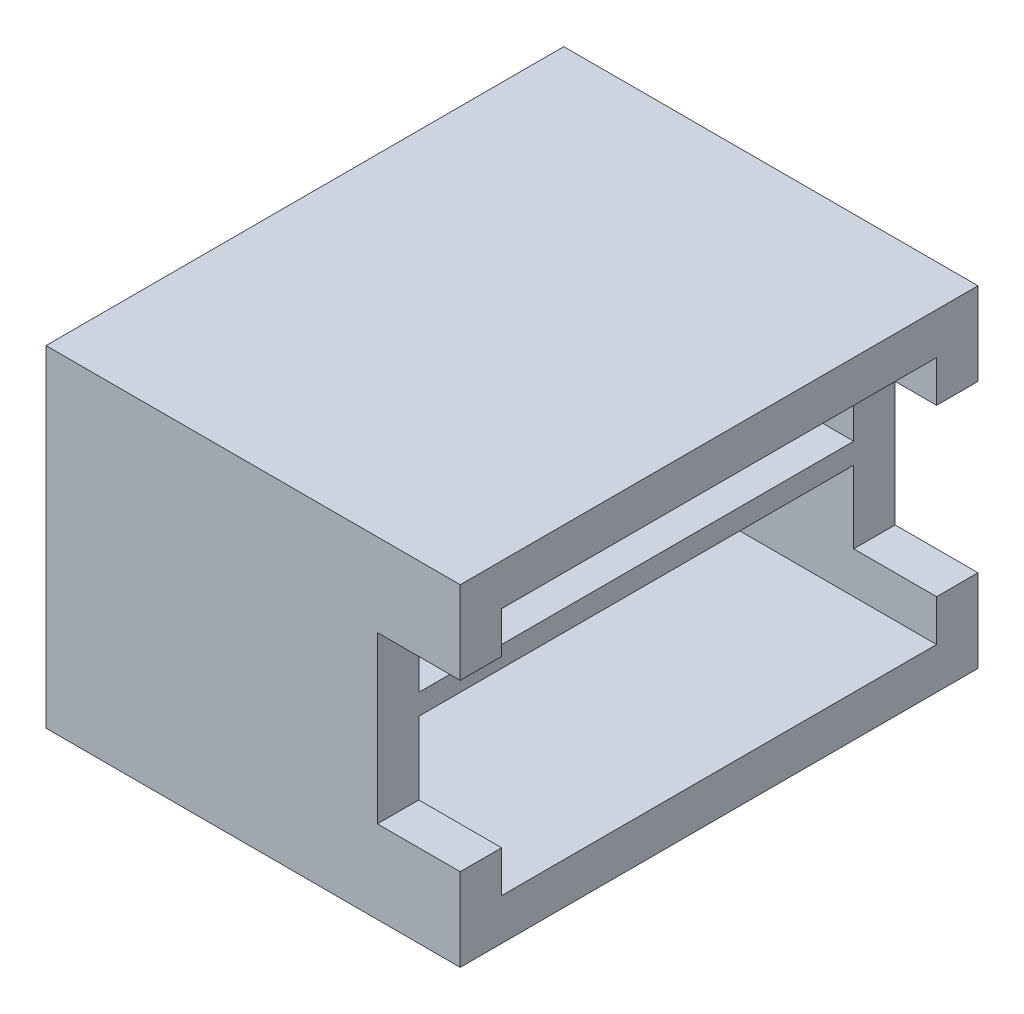
ISO-10303-21;
HEADER;
FILE_DESCRIPTION(('STEP AP214'),'2;1');
FILE_NAME('part.step','',(''),(''),'','','');
FILE_SCHEMA(('AUTOMOTIVE_DESIGN { 1 0 10303 214 1 1 1 1 }'));
ENDSEC;
DATA;
#1=APPLICATION_CONTEXT('core data for automotive mechanical design processes');
#2=APPLICATION_PROTOCOL_DEFINITION('international standard','automotive_design',2000,#1);
#3=PRODUCT_CONTEXT('',#1,'mechanical');
#4=PRODUCT('Part','Part','',(#3));
#5=PRODUCT_RELATED_PRODUCT_CATEGORY('part','',(#4));
#6=PRODUCT_DEFINITION_FORMATION('','',#4);
#7=PRODUCT_DEFINITION_CONTEXT('part definition',#1,'design');
#8=PRODUCT_DEFINITION('design','',#6,#7);
#9=PRODUCT_DEFINITION_SHAPE('','',#8);
#10=(LENGTH_UNIT() NAMED_UNIT(*) SI_UNIT(.MILLI.,.METRE.));
#11=(NAMED_UNIT(*) PLANE_ANGLE_UNIT() SI_UNIT($,.RADIAN.));
#12=(NAMED_UNIT(*) SI_UNIT($,.STERADIAN.) SOLID_ANGLE_UNIT());
#13=UNCERTAINTY_MEASURE_WITH_UNIT(LENGTH_MEASURE(1.E-05),#10,'distance_accuracy_value','');
#14=(GEOMETRIC_REPRESENTATION_CONTEXT(3) GLOBAL_UNCERTAINTY_ASSIGNED_CONTEXT((#13)) GLOBAL_UNIT_ASSIGNED_CONTEXT((#10,
#11,#12)) REPRESENTATION_CONTEXT('',''));
#15=CARTESIAN_POINT('',(0.,0.,0.));
#16=DIRECTION('',(0.,0.,1.));
#17=DIRECTION('',(1.,0.,0.));
#18=AXIS2_PLACEMENT_3D('',#15,#16,#17);
#19=CARTESIAN_POINT('',(-7.99999999999999,16.,10.5));
#20=DIRECTION('',(0.,0.,1.));
#21=DIRECTION('',(0.,-1.,0.));
#22=AXIS2_PLACEMENT_3D('',#19,#20,#21);
#23=PLANE('',#22);
#24=DIRECTION('',(1.,0.,0.));
#25=VECTOR('',#24,1.);
#26=CARTESIAN_POINT('',(6.,12.,10.5));
#27=LINE('',#26,#25);
#28=CARTESIAN_POINT('',(6.,12.,10.5));
#29=VERTEX_POINT('',#28);
#30=CARTESIAN_POINT('',(10.,12.,10.5));
#31=VERTEX_POINT('',#30);
#32=EDGE_CURVE('E276',#29,#31,#27,.T.);
#33=ORIENTED_EDGE('',*,*,#32,.F.);
#34=DIRECTION('',(0.,-1.,0.));
#35=VECTOR('',#34,1.);
#36=CARTESIAN_POINT('',(6.,0.,10.5));
#37=LINE('',#36,#35);
#38=CARTESIAN_POINT('',(6.,8.5,10.5));
#39=VERTEX_POINT('',#38);
#40=EDGE_CURVE('E267',#29,#39,#37,.T.);
#41=ORIENTED_EDGE('',*,*,#40,.T.);
#42=DIRECTION('',(-1.,0.,0.));
#43=VECTOR('',#42,1.);
#44=CARTESIAN_POINT('',(6.,8.5,10.5));
#45=LINE('',#44,#43);
#46=CARTESIAN_POINT('',(-7.99999999999999,8.5,10.5));
#47=VERTEX_POINT('',#46);
#48=EDGE_CURVE('E315',#39,#47,#45,.T.);
#49=ORIENTED_EDGE('',*,*,#48,.T.);
#50=DIRECTION('',(0.,-1.,0.));
#51=VECTOR('',#50,1.);
#52=CARTESIAN_POINT('',(-7.99999999999999,16.,10.5));
#53=LINE('',#52,#51);
#54=CARTESIAN_POINT('',(-7.99999999999999,14.,10.5));
#55=VERTEX_POINT('',#54);
#56=EDGE_CURVE('E336',#55,#47,#53,.T.);
#57=ORIENTED_EDGE('',*,*,#56,.F.);
#58=DIRECTION('',(1.,0.,0.));
#59=VECTOR('',#58,1.);
#60=CARTESIAN_POINT('',(-7.99999999999999,14.,10.5));
#61=LINE('',#60,#59);
#62=CARTESIAN_POINT('',(10.,14.,10.5));
#63=VERTEX_POINT('',#62);
#64=EDGE_CURVE('E355',#55,#63,#61,.T.);
#65=ORIENTED_EDGE('',*,*,#64,.T.);
#66=DIRECTION('',(0.,-1.,0.));
#67=VECTOR('',#66,1.);
#68=CARTESIAN_POINT('',(10.,16.,10.5));
#69=LINE('',#68,#67);
#70=EDGE_CURVE('E328',#63,#31,#69,.T.);
#71=ORIENTED_EDGE('',*,*,#70,.T.);
#72=EDGE_LOOP('',(#33,#41,#49,#57,#65,#71));
#73=FACE_BOUND('',#72,.T.);
#74=ADVANCED_FACE('F39',(#73),#23,.F.);
#75=DIRECTION('',(1.,0.,0.));
#76=VECTOR('',#75,1.);
#77=CARTESIAN_POINT('',(6.,4.,10.5));
#78=LINE('',#77,#76);
#79=CARTESIAN_POINT('',(6.,4.,10.5));
#80=VERTEX_POINT('',#79);
#81=CARTESIAN_POINT('',(10.,4.,10.5));
#82=VERTEX_POINT('',#81);
#83=EDGE_CURVE('E273',#80,#82,#78,.T.);
#84=ORIENTED_EDGE('',*,*,#83,.T.);
#85=CARTESIAN_POINT('',(10.,2.,10.5));
#86=VERTEX_POINT('',#85);
#87=EDGE_CURVE('E348',#82,#86,#69,.T.);
#88=ORIENTED_EDGE('',*,*,#87,.T.);
#89=DIRECTION('',(1.,0.,0.));
#90=VECTOR('',#89,1.);
#91=CARTESIAN_POINT('',(-7.99999999999999,2.,10.5));
#92=LINE('',#91,#90);
#93=CARTESIAN_POINT('',(-7.99999999999999,2.,10.5));
#94=VERTEX_POINT('',#93);
#95=EDGE_CURVE('E351',#94,#86,#92,.T.);
#96=ORIENTED_EDGE('',*,*,#95,.F.);
#97=CARTESIAN_POINT('',(-7.99999999999999,7.5,10.5));
#98=VERTEX_POINT('',#97);
#99=EDGE_CURVE('E335',#98,#94,#53,.T.);
#100=ORIENTED_EDGE('',*,*,#99,.F.);
#101=DIRECTION('',(-1.,0.,0.));
#102=VECTOR('',#101,1.);
#103=CARTESIAN_POINT('',(6.,7.5,10.5));
#104=LINE('',#103,#102);
#105=CARTESIAN_POINT('',(6.,7.5,10.5));
#106=VERTEX_POINT('',#105);
#107=EDGE_CURVE('E313',#106,#98,#104,.T.);
#108=ORIENTED_EDGE('',*,*,#107,.F.);
#109=EDGE_CURVE('E266',#106,#80,#37,.T.);
#110=ORIENTED_EDGE('',*,*,#109,.T.);
#111=EDGE_LOOP('',(#84,#88,#96,#100,#108,#110));
#112=FACE_BOUND('',#111,.T.);
#113=ADVANCED_FACE('F480',(#112),#23,.F.);
#114=CARTESIAN_POINT('',(-8.,16.,-10.5));
#115=DIRECTION('',(0.,0.,-1.));
#116=DIRECTION('',(0.,1.,0.));
#117=AXIS2_PLACEMENT_3D('',#114,#115,#116);
#118=PLANE('',#117);
#119=DIRECTION('',(1.,0.,0.));
#120=VECTOR('',#119,1.);
#121=CARTESIAN_POINT('',(6.,4.,-10.5));
#122=LINE('',#121,#120);
#123=CARTESIAN_POINT('',(6.,4.,-10.5));
#124=VERTEX_POINT('',#123);
#125=CARTESIAN_POINT('',(10.,4.,-10.5));
#126=VERTEX_POINT('',#125);
#127=EDGE_CURVE('E291',#124,#126,#122,.T.);
#128=ORIENTED_EDGE('',*,*,#127,.F.);
#129=DIRECTION('',(0.,1.,0.));
#130=VECTOR('',#129,1.);
#131=CARTESIAN_POINT('',(6.,0.,-10.5));
#132=LINE('',#131,#130);
#133=CARTESIAN_POINT('',(6.,7.5,-10.5));
#134=VERTEX_POINT('',#133);
#135=EDGE_CURVE('E282',#124,#134,#132,.T.);
#136=ORIENTED_EDGE('',*,*,#135,.T.);
#137=DIRECTION('',(-1.,0.,0.));
#138=VECTOR('',#137,1.);
#139=CARTESIAN_POINT('',(6.,7.5,-10.5));
#140=LINE('',#139,#138);
#141=CARTESIAN_POINT('',(-8.,7.5,-10.5));
#142=VERTEX_POINT('',#141);
#143=EDGE_CURVE('E320',#134,#142,#140,.T.);
#144=ORIENTED_EDGE('',*,*,#143,.T.);
#145=DIRECTION('',(0.,1.,0.));
#146=VECTOR('',#145,1.);
#147=CARTESIAN_POINT('',(-8.,16.,-10.5));
#148=LINE('',#147,#146);
#149=CARTESIAN_POINT('',(-8.,2.,-10.5));
#150=VERTEX_POINT('',#149);
#151=EDGE_CURVE('E329',#150,#142,#148,.T.);
#152=ORIENTED_EDGE('',*,*,#151,.F.);
#153=DIRECTION('',(1.,0.,0.));
#154=VECTOR('',#153,1.);
#155=CARTESIAN_POINT('',(-8.,2.,-10.5));
#156=LINE('',#155,#154);
#157=CARTESIAN_POINT('',(10.,2.,-10.5));
#158=VERTEX_POINT('',#157);
#159=EDGE_CURVE('E339',#150,#158,#156,.T.);
#160=ORIENTED_EDGE('',*,*,#159,.T.);
#161=DIRECTION('',(0.,1.,0.));
#162=VECTOR('',#161,1.);
#163=CARTESIAN_POINT('',(10.,16.,-10.5));
#164=LINE('',#163,#162);
#165=EDGE_CURVE('E342',#158,#126,#164,.T.);
#166=ORIENTED_EDGE('',*,*,#165,.T.);
#167=EDGE_LOOP('',(#128,#136,#144,#152,#160,#166));
#168=FACE_BOUND('',#167,.T.);
#169=ADVANCED_FACE('F486',(#168),#118,.F.);
#170=DIRECTION('',(1.,0.,0.));
#171=VECTOR('',#170,1.);
#172=CARTESIAN_POINT('',(6.,12.,-10.5));
#173=LINE('',#172,#171);
#174=CARTESIAN_POINT('',(6.,12.,-10.5));
#175=VERTEX_POINT('',#174);
#176=CARTESIAN_POINT('',(10.,12.,-10.5));
#177=VERTEX_POINT('',#176);
#178=EDGE_CURVE('E264',#175,#177,#173,.T.);
#179=ORIENTED_EDGE('',*,*,#178,.T.);
#180=CARTESIAN_POINT('',(10.,14.,-10.5));
#181=VERTEX_POINT('',#180);
#182=EDGE_CURVE('E341',#177,#181,#164,.T.);
#183=ORIENTED_EDGE('',*,*,#182,.T.);
#184=DIRECTION('',(1.,0.,0.));
#185=VECTOR('',#184,1.);
#186=CARTESIAN_POINT('',(-8.,14.,-10.5));
#187=LINE('',#186,#185);
#188=CARTESIAN_POINT('',(-8.,14.,-10.5));
#189=VERTEX_POINT('',#188);
#190=EDGE_CURVE('E357',#189,#181,#187,.T.);
#191=ORIENTED_EDGE('',*,*,#190,.F.);
#192=CARTESIAN_POINT('',(-8.,8.5,-10.5));
#193=VERTEX_POINT('',#192);
#194=EDGE_CURVE('E327',#193,#189,#148,.T.);
#195=ORIENTED_EDGE('',*,*,#194,.F.);
#196=DIRECTION('',(-1.,0.,0.));
#197=VECTOR('',#196,1.);
#198=CARTESIAN_POINT('',(6.,8.5,-10.5));
#199=LINE('',#198,#197);
#200=CARTESIAN_POINT('',(6.,8.5,-10.5));
#201=VERTEX_POINT('',#200);
#202=EDGE_CURVE('E318',#201,#193,#199,.T.);
#203=ORIENTED_EDGE('',*,*,#202,.F.);
#204=EDGE_CURVE('E251',#201,#175,#132,.T.);
#205=ORIENTED_EDGE('',*,*,#204,.T.);
#206=EDGE_LOOP('',(#179,#183,#191,#195,#203,#205));
#207=FACE_BOUND('',#206,.T.);
#208=ADVANCED_FACE('F501',(#207),#118,.F.);
#209=CARTESIAN_POINT('',(-10.,16.,-12.5));
#210=DIRECTION('',(0.,0.,1.));
#211=DIRECTION('',(1.,0.,0.));
#212=AXIS2_PLACEMENT_3D('',#209,#210,#211);
#213=PLANE('',#212);
#214=DIRECTION('',(1.,0.,0.));
#215=VECTOR('',#214,1.);
#216=CARTESIAN_POINT('',(6.,12.,-12.5));
#217=LINE('',#216,#215);
#218=CARTESIAN_POINT('',(6.,12.,-12.5));
#219=VERTEX_POINT('',#218);
#220=CARTESIAN_POINT('',(10.,12.,-12.5));
#221=VERTEX_POINT('',#220);
#222=EDGE_CURVE('E296',#219,#221,#217,.T.);
#223=ORIENTED_EDGE('',*,*,#222,.F.);
#224=DIRECTION('',(0.,-1.,0.));
#225=VECTOR('',#224,1.);
#226=CARTESIAN_POINT('',(6.,0.,-12.5));
#227=LINE('',#226,#225);
#228=CARTESIAN_POINT('',(6.,4.,-12.5));
#229=VERTEX_POINT('',#228);
#230=EDGE_CURVE('E286',#219,#229,#227,.T.);
#231=ORIENTED_EDGE('',*,*,#230,.T.);
#232=DIRECTION('',(1.,0.,0.));
#233=VECTOR('',#232,1.);
#234=CARTESIAN_POINT('',(6.,4.,-12.5));
#235=LINE('',#234,#233);
#236=CARTESIAN_POINT('',(10.,4.,-12.5));
#237=VERTEX_POINT('',#236);
#238=EDGE_CURVE('E293',#229,#237,#235,.T.);
#239=ORIENTED_EDGE('',*,*,#238,.T.);
#240=DIRECTION('',(0.,-1.,0.));
#241=VECTOR('',#240,1.);
#242=CARTESIAN_POINT('',(10.,16.,-12.5));
#243=LINE('',#242,#241);
#244=CARTESIAN_POINT('',(10.,0.,-12.5));
#245=VERTEX_POINT('',#244);
#246=EDGE_CURVE('E391',#237,#245,#243,.T.);
#247=ORIENTED_EDGE('',*,*,#246,.T.);
#248=DIRECTION('',(-1.,0.,0.));
#249=VECTOR('',#248,1.);
#250=CARTESIAN_POINT('',(-10.,0.,-12.5));
#251=LINE('',#250,#249);
#252=CARTESIAN_POINT('',(-10.,0.,-12.5));
#253=VERTEX_POINT('',#252);
#254=EDGE_CURVE('E375',#245,#253,#251,.T.);
#255=ORIENTED_EDGE('',*,*,#254,.T.);
#256=DIRECTION('',(0.,-1.,0.));
#257=VECTOR('',#256,1.);
#258=CARTESIAN_POINT('',(-10.,16.,-12.5));
#259=LINE('',#258,#257);
#260=CARTESIAN_POINT('',(-10.,16.,-12.5));
#261=VERTEX_POINT('',#260);
#262=EDGE_CURVE('E388',#261,#253,#259,.T.);
#263=ORIENTED_EDGE('',*,*,#262,.F.);
#264=DIRECTION('',(-1.,0.,0.));
#265=VECTOR('',#264,1.);
#266=CARTESIAN_POINT('',(-10.,16.,-12.5));
#267=LINE('',#266,#265);
#268=CARTESIAN_POINT('',(10.,16.,-12.5));
#269=VERTEX_POINT('',#268);
#270=EDGE_CURVE('E365',#269,#261,#267,.T.);
#271=ORIENTED_EDGE('',*,*,#270,.F.);
#272=EDGE_CURVE('E392',#269,#221,#243,.T.);
#273=ORIENTED_EDGE('',*,*,#272,.T.);
#274=EDGE_LOOP('',(#223,#231,#239,#247,#255,#263,#271,#273));
#275=FACE_BOUND('',#274,.T.);
#276=ADVANCED_FACE('F428',(#275),#213,.F.);
#277=CARTESIAN_POINT('',(-10.,16.,12.5));
#278=DIRECTION('',(0.,0.,-1.));
#279=DIRECTION('',(-1.,0.,0.));
#280=AXIS2_PLACEMENT_3D('',#277,#278,#279);
#281=PLANE('',#280);
#282=DIRECTION('',(1.,0.,0.));
#283=VECTOR('',#282,1.);
#284=CARTESIAN_POINT('',(6.,12.,12.5));
#285=LINE('',#284,#283);
#286=CARTESIAN_POINT('',(6.,12.,12.5));
#287=VERTEX_POINT('',#286);
#288=CARTESIAN_POINT('',(10.,12.,12.5));
#289=VERTEX_POINT('',#288);
#290=EDGE_CURVE('E278',#287,#289,#285,.T.);
#291=ORIENTED_EDGE('',*,*,#290,.T.);
#292=DIRECTION('',(0.,-1.,0.));
#293=VECTOR('',#292,1.);
#294=CARTESIAN_POINT('',(10.,16.,12.5));
#295=LINE('',#294,#293);
#296=CARTESIAN_POINT('',(10.,16.,12.5));
#297=VERTEX_POINT('',#296);
#298=EDGE_CURVE('E382',#297,#289,#295,.T.);
#299=ORIENTED_EDGE('',*,*,#298,.F.);
#300=DIRECTION('',(1.,0.,0.));
#301=VECTOR('',#300,1.);
#302=CARTESIAN_POINT('',(-10.,16.,12.5));
#303=LINE('',#302,#301);
#304=CARTESIAN_POINT('',(-10.,16.,12.5));
#305=VERTEX_POINT('',#304);
#306=EDGE_CURVE('E370',#305,#297,#303,.T.);
#307=ORIENTED_EDGE('',*,*,#306,.F.);
#308=DIRECTION('',(0.,-1.,0.));
#309=VECTOR('',#308,1.);
#310=CARTESIAN_POINT('',(-10.,16.,12.5));
#311=LINE('',#310,#309);
#312=CARTESIAN_POINT('',(-10.,0.,12.5));
#313=VERTEX_POINT('',#312);
#314=EDGE_CURVE('E385',#305,#313,#311,.T.);
#315=ORIENTED_EDGE('',*,*,#314,.T.);
#316=DIRECTION('',(1.,0.,0.));
#317=VECTOR('',#316,1.);
#318=CARTESIAN_POINT('',(-10.,0.,12.5));
#319=LINE('',#318,#317);
#320=CARTESIAN_POINT('',(10.,0.,12.5));
#321=VERTEX_POINT('',#320);
#322=EDGE_CURVE('E366',#313,#321,#319,.T.);
#323=ORIENTED_EDGE('',*,*,#322,.T.);
#324=CARTESIAN_POINT('',(10.,4.,12.5));
#325=VERTEX_POINT('',#324);
#326=EDGE_CURVE('E372',#325,#321,#295,.T.);
#327=ORIENTED_EDGE('',*,*,#326,.F.);
#328=DIRECTION('',(1.,0.,0.));
#329=VECTOR('',#328,1.);
#330=CARTESIAN_POINT('',(6.,4.,12.5));
#331=LINE('',#330,#329);
#332=CARTESIAN_POINT('',(6.,4.,12.5));
#333=VERTEX_POINT('',#332);
#334=EDGE_CURVE('E271',#333,#325,#331,.T.);
#335=ORIENTED_EDGE('',*,*,#334,.F.);
#336=DIRECTION('',(0.,1.,0.));
#337=VECTOR('',#336,1.);
#338=CARTESIAN_POINT('',(6.,0.,12.5));
#339=LINE('',#338,#337);
#340=EDGE_CURVE('E260',#333,#287,#339,.T.);
#341=ORIENTED_EDGE('',*,*,#340,.T.);
#342=EDGE_LOOP('',(#291,#299,#307,#315,#323,#327,#335,#341));
#343=FACE_BOUND('',#342,.T.);
#344=ADVANCED_FACE('F440',(#343),#281,.F.);
#345=CARTESIAN_POINT('',(10.,16.,-12.5));
#346=DIRECTION('',(-1.,0.,0.));
#347=DIRECTION('',(0.,0.,1.));
#348=AXIS2_PLACEMENT_3D('',#345,#346,#347);
#349=PLANE('',#348);
#350=DIRECTION('',(0.,0.,1.));
#351=VECTOR('',#350,1.);
#352=CARTESIAN_POINT('',(10.,12.,-12.5));
#353=LINE('',#352,#351);
#354=EDGE_CURVE('E281',#221,#177,#353,.T.);
#355=ORIENTED_EDGE('',*,*,#354,.F.);
#356=ORIENTED_EDGE('',*,*,#272,.F.);
#357=DIRECTION('',(0.,0.,-1.));
#358=VECTOR('',#357,1.);
#359=CARTESIAN_POINT('',(10.,16.,-12.5));
#360=LINE('',#359,#358);
#361=EDGE_CURVE('E362',#297,#269,#360,.T.);
#362=ORIENTED_EDGE('',*,*,#361,.F.);
#363=ORIENTED_EDGE('',*,*,#298,.T.);
#364=DIRECTION('',(0.,0.,1.));
#365=VECTOR('',#364,1.);
#366=CARTESIAN_POINT('',(10.,12.,-12.5));
#367=LINE('',#366,#365);
#368=EDGE_CURVE('E303',#31,#289,#367,.T.);
#369=ORIENTED_EDGE('',*,*,#368,.F.);
#370=ORIENTED_EDGE('',*,*,#70,.F.);
#371=DIRECTION('',(0.,0.,1.));
#372=VECTOR('',#371,1.);
#373=CARTESIAN_POINT('',(10.,14.,-12.5));
#374=LINE('',#373,#372);
#375=EDGE_CURVE('E345',#181,#63,#374,.T.);
#376=ORIENTED_EDGE('',*,*,#375,.F.);
#377=ORIENTED_EDGE('',*,*,#182,.F.);
#378=EDGE_LOOP('',(#355,#356,#362,#363,#369,#370,#376,#377));
#379=FACE_BOUND('',#378,.T.);
#380=ADVANCED_FACE('F41',(#379),#349,.F.);
#381=DIRECTION('',(0.,0.,-1.));
#382=VECTOR('',#381,1.);
#383=CARTESIAN_POINT('',(10.,4.,-12.5));
#384=LINE('',#383,#382);
#385=EDGE_CURVE('E301',#126,#237,#384,.T.);
#386=ORIENTED_EDGE('',*,*,#385,.F.);
#387=ORIENTED_EDGE('',*,*,#165,.F.);
#388=DIRECTION('',(0.,0.,-1.));
#389=VECTOR('',#388,1.);
#390=CARTESIAN_POINT('',(10.,2.,-12.5));
#391=LINE('',#390,#389);
#392=EDGE_CURVE('E323',#86,#158,#391,.T.);
#393=ORIENTED_EDGE('',*,*,#392,.F.);
#394=ORIENTED_EDGE('',*,*,#87,.F.);
#395=DIRECTION('',(0.,0.,-1.));
#396=VECTOR('',#395,1.);
#397=CARTESIAN_POINT('',(10.,4.,-12.5));
#398=LINE('',#397,#396);
#399=EDGE_CURVE('E305',#325,#82,#398,.T.);
#400=ORIENTED_EDGE('',*,*,#399,.F.);
#401=ORIENTED_EDGE('',*,*,#326,.T.);
#402=DIRECTION('',(0.,0.,-1.));
#403=VECTOR('',#402,1.);
#404=CARTESIAN_POINT('',(10.,0.,-12.5));
#405=LINE('',#404,#403);
#406=EDGE_CURVE('E354',#321,#245,#405,.T.);
#407=ORIENTED_EDGE('',*,*,#406,.T.);
#408=ORIENTED_EDGE('',*,*,#246,.F.);
#409=EDGE_LOOP('',(#386,#387,#393,#394,#400,#401,#407,#408));
#410=FACE_BOUND('',#409,.T.);
#411=ADVANCED_FACE('F432',(#410),#349,.F.);
#412=CARTESIAN_POINT('',(-8.,0.,0.));
#413=DIRECTION('',(1.,0.,0.));
#414=DIRECTION('',(0.,0.,-1.));
#415=AXIS2_PLACEMENT_3D('',#412,#413,#414);
#416=PLANE('',#415);
#417=ORIENTED_EDGE('',*,*,#151,.T.);
#418=DIRECTION('',(0.,0.,1.));
#419=VECTOR('',#418,1.);
#420=CARTESIAN_POINT('',(-8.,7.5,0.));
#421=LINE('',#420,#419);
#422=EDGE_CURVE('E398',#142,#98,#421,.T.);
#423=ORIENTED_EDGE('',*,*,#422,.T.);
#424=ORIENTED_EDGE('',*,*,#99,.T.);
#425=DIRECTION('',(0.,0.,-1.));
#426=VECTOR('',#425,1.);
#427=CARTESIAN_POINT('',(-8.,2.,-12.5));
#428=LINE('',#427,#426);
#429=EDGE_CURVE('E324',#94,#150,#428,.T.);
#430=ORIENTED_EDGE('',*,*,#429,.T.);
#431=EDGE_LOOP('',(#417,#423,#424,#430));
#432=FACE_BOUND('',#431,.T.);
#433=ADVANCED_FACE('F491',(#432),#416,.T.);
#434=ORIENTED_EDGE('',*,*,#56,.T.);
#435=DIRECTION('',(0.,0.,-1.));
#436=VECTOR('',#435,1.);
#437=CARTESIAN_POINT('',(-8.,8.5,0.));
#438=LINE('',#437,#436);
#439=EDGE_CURVE('E395',#47,#193,#438,.T.);
#440=ORIENTED_EDGE('',*,*,#439,.T.);
#441=ORIENTED_EDGE('',*,*,#194,.T.);
#442=DIRECTION('',(0.,0.,1.));
#443=VECTOR('',#442,1.);
#444=CARTESIAN_POINT('',(-8.,14.,-12.5));
#445=LINE('',#444,#443);
#446=EDGE_CURVE('E332',#189,#55,#445,.T.);
#447=ORIENTED_EDGE('',*,*,#446,.T.);
#448=EDGE_LOOP('',(#434,#440,#441,#447));
#449=FACE_BOUND('',#448,.T.);
#450=ADVANCED_FACE('F515',(#449),#416,.T.);
#451=CARTESIAN_POINT('',(-10.,16.,-12.5));
#452=DIRECTION('',(1.,0.,0.));
#453=DIRECTION('',(0.,0.,-1.));
#454=AXIS2_PLACEMENT_3D('',#451,#452,#453);
#455=PLANE('',#454);
#456=DIRECTION('',(0.,0.,1.));
#457=VECTOR('',#456,1.);
#458=CARTESIAN_POINT('',(-10.,0.,-12.5));
#459=LINE('',#458,#457);
#460=CARTESIAN_POINT('',(-10.,0.,-5.5));
#461=VERTEX_POINT('',#460);
#462=EDGE_CURVE('E378',#253,#461,#459,.T.);
#463=ORIENTED_EDGE('',*,*,#462,.T.);
#464=DIRECTION('',(0.,1.,0.));
#465=VECTOR('',#464,1.);
#466=CARTESIAN_POINT('',(-10.,-3.,-5.5));
#467=LINE('',#466,#465);
#468=CARTESIAN_POINT('',(-10.,-3.,-5.5));
#469=VERTEX_POINT('',#468);
#470=EDGE_CURVE('E254',#469,#461,#467,.T.);
#471=ORIENTED_EDGE('',*,*,#470,.F.);
#472=DIRECTION('',(0.,0.,1.));
#473=VECTOR('',#472,1.);
#474=CARTESIAN_POINT('',(-10.,-3.,-5.5));
#475=LINE('',#474,#473);
#476=CARTESIAN_POINT('',(-10.,-3.,5.5));
#477=VERTEX_POINT('',#476);
#478=EDGE_CURVE('E445',#469,#477,#475,.T.);
#479=ORIENTED_EDGE('',*,*,#478,.T.);
#480=DIRECTION('',(0.,1.,0.));
#481=VECTOR('',#480,1.);
#482=CARTESIAN_POINT('',(-10.,-3.,5.5));
#483=LINE('',#482,#481);
#484=CARTESIAN_POINT('',(-10.,0.,5.5));
#485=VERTEX_POINT('',#484);
#486=EDGE_CURVE('E252',#477,#485,#483,.T.);
#487=ORIENTED_EDGE('',*,*,#486,.T.);
#488=EDGE_CURVE('E377',#485,#313,#459,.T.);
#489=ORIENTED_EDGE('',*,*,#488,.T.);
#490=ORIENTED_EDGE('',*,*,#314,.F.);
#491=DIRECTION('',(0.,0.,1.));
#492=VECTOR('',#491,1.);
#493=CARTESIAN_POINT('',(-10.,16.,-12.5));
#494=LINE('',#493,#492);
#495=EDGE_CURVE('E368',#261,#305,#494,.T.);
#496=ORIENTED_EDGE('',*,*,#495,.F.);
#497=ORIENTED_EDGE('',*,*,#262,.T.);
#498=EDGE_LOOP('',(#463,#471,#479,#487,#489,#490,#496,#497));
#499=FACE_BOUND('',#498,.T.);
#500=ADVANCED_FACE('F420',(#499),#455,.F.);
#501=CARTESIAN_POINT('',(0.,16.,0.));
#502=DIRECTION('',(0.,1.,0.));
#503=DIRECTION('',(0.,0.,1.));
#504=AXIS2_PLACEMENT_3D('',#501,#502,#503);
#505=PLANE('',#504);
#506=ORIENTED_EDGE('',*,*,#361,.T.);
#507=ORIENTED_EDGE('',*,*,#270,.T.);
#508=ORIENTED_EDGE('',*,*,#495,.T.);
#509=ORIENTED_EDGE('',*,*,#306,.T.);
#510=EDGE_LOOP('',(#506,#507,#508,#509));
#511=FACE_BOUND('',#510,.T.);
#512=ADVANCED_FACE('F506',(#511),#505,.T.);
#513=CARTESIAN_POINT('',(0.,0.,0.));
#514=DIRECTION('',(0.,1.,0.));
#515=DIRECTION('',(0.,0.,1.));
#516=AXIS2_PLACEMENT_3D('',#513,#514,#515);
#517=PLANE('',#516);
#518=DIRECTION('',(0.,0.,1.));
#519=VECTOR('',#518,1.);
#520=CARTESIAN_POINT('',(1.25,0.,-21.5));
#521=LINE('',#520,#519);
#522=CARTESIAN_POINT('',(1.25,0.,-5.5));
#523=VERTEX_POINT('',#522);
#524=CARTESIAN_POINT('',(1.25,0.,5.5));
#525=VERTEX_POINT('',#524);
#526=EDGE_CURVE('E54',#523,#525,#521,.T.);
#527=ORIENTED_EDGE('',*,*,#526,.T.);
#528=DIRECTION('',(1.,0.,0.));
#529=VECTOR('',#528,1.);
#530=CARTESIAN_POINT('',(-10.,0.,5.5));
#531=LINE('',#530,#529);
#532=CARTESIAN_POINT('',(2.75,0.,5.5));
#533=VERTEX_POINT('',#532);
#534=EDGE_CURVE('E239',#525,#533,#531,.T.);
#535=ORIENTED_EDGE('',*,*,#534,.T.);
#536=DIRECTION('',(0.,0.,-1.));
#537=VECTOR('',#536,1.);
#538=CARTESIAN_POINT('',(2.75,0.,-5.5));
#539=LINE('',#538,#537);
#540=CARTESIAN_POINT('',(2.75,0.,-5.5));
#541=VERTEX_POINT('',#540);
#542=EDGE_CURVE('E238',#533,#541,#539,.T.);
#543=ORIENTED_EDGE('',*,*,#542,.T.);
#544=DIRECTION('',(-1.,0.,0.));
#545=VECTOR('',#544,1.);
#546=CARTESIAN_POINT('',(-10.,0.,-5.5));
#547=LINE('',#546,#545);
#548=EDGE_CURVE('E233',#541,#523,#547,.T.);
#549=ORIENTED_EDGE('',*,*,#548,.T.);
#550=EDGE_LOOP('',(#527,#535,#543,#549));
#551=FACE_BOUND('',#550,.T.);
#552=CARTESIAN_POINT('',(-8.5,0.,5.5));
#553=VERTEX_POINT('',#552);
#554=EDGE_CURVE('E242',#485,#553,#531,.T.);
#555=ORIENTED_EDGE('',*,*,#554,.T.);
#556=DIRECTION('',(0.,0.,1.));
#557=VECTOR('',#556,1.);
#558=CARTESIAN_POINT('',(-8.5,0.,-21.5));
#559=LINE('',#558,#557);
#560=CARTESIAN_POINT('',(-8.5,0.,-5.5));
#561=VERTEX_POINT('',#560);
#562=EDGE_CURVE('E62',#561,#553,#559,.T.);
#563=ORIENTED_EDGE('',*,*,#562,.F.);
#564=EDGE_CURVE('E240',#561,#461,#547,.T.);
#565=ORIENTED_EDGE('',*,*,#564,.T.);
#566=ORIENTED_EDGE('',*,*,#462,.F.);
#567=ORIENTED_EDGE('',*,*,#254,.F.);
#568=ORIENTED_EDGE('',*,*,#406,.F.);
#569=ORIENTED_EDGE('',*,*,#322,.F.);
#570=ORIENTED_EDGE('',*,*,#488,.F.);
#571=EDGE_LOOP('',(#555,#563,#565,#566,#567,#568,#569,#570));
#572=FACE_BOUND('',#571,.T.);
#573=ADVANCED_FACE('F236',(#551,#572),#517,.F.);
#574=CARTESIAN_POINT('',(-8.,2.,-12.5));
#575=DIRECTION('',(0.,-1.,0.));
#576=DIRECTION('',(0.,0.,-1.));
#577=AXIS2_PLACEMENT_3D('',#574,#575,#576);
#578=PLANE('',#577);
#579=ORIENTED_EDGE('',*,*,#392,.T.);
#580=ORIENTED_EDGE('',*,*,#159,.F.);
#581=ORIENTED_EDGE('',*,*,#429,.F.);
#582=ORIENTED_EDGE('',*,*,#95,.T.);
#583=EDGE_LOOP('',(#579,#580,#581,#582));
#584=FACE_BOUND('',#583,.T.);
#585=ADVANCED_FACE('F497',(#584),#578,.F.);
#586=CARTESIAN_POINT('',(-8.,14.,-12.5));
#587=DIRECTION('',(0.,1.,0.));
#588=DIRECTION('',(0.,0.,1.));
#589=AXIS2_PLACEMENT_3D('',#586,#587,#588);
#590=PLANE('',#589);
#591=ORIENTED_EDGE('',*,*,#375,.T.);
#592=ORIENTED_EDGE('',*,*,#64,.F.);
#593=ORIENTED_EDGE('',*,*,#446,.F.);
#594=ORIENTED_EDGE('',*,*,#190,.T.);
#595=EDGE_LOOP('',(#591,#592,#593,#594));
#596=FACE_BOUND('',#595,.T.);
#597=ADVANCED_FACE('F493',(#596),#590,.F.);
#598=CARTESIAN_POINT('',(6.,7.5,-12.5));
#599=DIRECTION('',(0.,1.,0.));
#600=DIRECTION('',(0.,0.,1.));
#601=AXIS2_PLACEMENT_3D('',#598,#599,#600);
#602=PLANE('',#601);
#603=ORIENTED_EDGE('',*,*,#422,.F.);
#604=ORIENTED_EDGE('',*,*,#143,.F.);
#605=DIRECTION('',(0.,0.,-1.));
#606=VECTOR('',#605,1.);
#607=CARTESIAN_POINT('',(6.,7.5,-12.5));
#608=LINE('',#607,#606);
#609=EDGE_CURVE('E307',#106,#134,#608,.T.);
#610=ORIENTED_EDGE('',*,*,#609,.F.);
#611=ORIENTED_EDGE('',*,*,#107,.T.);
#612=EDGE_LOOP('',(#603,#604,#610,#611));
#613=FACE_BOUND('',#612,.T.);
#614=ADVANCED_FACE('F496',(#613),#602,.F.);
#615=CARTESIAN_POINT('',(6.,8.5,-12.5));
#616=DIRECTION('',(0.,-1.,0.));
#617=DIRECTION('',(0.,0.,-1.));
#618=AXIS2_PLACEMENT_3D('',#615,#616,#617);
#619=PLANE('',#618);
#620=ORIENTED_EDGE('',*,*,#439,.F.);
#621=ORIENTED_EDGE('',*,*,#48,.F.);
#622=DIRECTION('',(0.,0.,1.));
#623=VECTOR('',#622,1.);
#624=CARTESIAN_POINT('',(6.,8.5,-12.5));
#625=LINE('',#624,#623);
#626=EDGE_CURVE('E310',#201,#39,#625,.T.);
#627=ORIENTED_EDGE('',*,*,#626,.F.);
#628=ORIENTED_EDGE('',*,*,#202,.T.);
#629=EDGE_LOOP('',(#620,#621,#627,#628));
#630=FACE_BOUND('',#629,.T.);
#631=ADVANCED_FACE('F541',(#630),#619,.F.);
#632=CARTESIAN_POINT('',(6.,0.,0.));
#633=DIRECTION('',(1.,0.,0.));
#634=DIRECTION('',(0.,0.,-1.));
#635=AXIS2_PLACEMENT_3D('',#632,#633,#634);
#636=PLANE('',#635);
#637=ORIENTED_EDGE('',*,*,#609,.T.);
#638=ORIENTED_EDGE('',*,*,#135,.F.);
#639=DIRECTION('',(0.,0.,1.));
#640=VECTOR('',#639,1.);
#641=CARTESIAN_POINT('',(6.,4.,0.));
#642=LINE('',#641,#640);
#643=EDGE_CURVE('E289',#229,#124,#642,.T.);
#644=ORIENTED_EDGE('',*,*,#643,.F.);
#645=ORIENTED_EDGE('',*,*,#230,.F.);
#646=DIRECTION('',(0.,0.,-1.));
#647=VECTOR('',#646,1.);
#648=CARTESIAN_POINT('',(6.,12.,0.));
#649=LINE('',#648,#647);
#650=EDGE_CURVE('E284',#175,#219,#649,.T.);
#651=ORIENTED_EDGE('',*,*,#650,.F.);
#652=ORIENTED_EDGE('',*,*,#204,.F.);
#653=ORIENTED_EDGE('',*,*,#626,.T.);
#654=ORIENTED_EDGE('',*,*,#40,.F.);
#655=DIRECTION('',(0.,0.,-1.));
#656=VECTOR('',#655,1.);
#657=CARTESIAN_POINT('',(6.,12.,0.));
#658=LINE('',#657,#656);
#659=EDGE_CURVE('E263',#287,#29,#658,.T.);
#660=ORIENTED_EDGE('',*,*,#659,.F.);
#661=ORIENTED_EDGE('',*,*,#340,.F.);
#662=DIRECTION('',(0.,0.,1.));
#663=VECTOR('',#662,1.);
#664=CARTESIAN_POINT('',(6.,4.,0.));
#665=LINE('',#664,#663);
#666=EDGE_CURVE('E269',#80,#333,#665,.T.);
#667=ORIENTED_EDGE('',*,*,#666,.F.);
#668=ORIENTED_EDGE('',*,*,#109,.F.);
#669=EDGE_LOOP('',(#637,#638,#644,#645,#651,#652,#653,#654,#660,#661,#667,#668));
#670=FACE_BOUND('',#669,.T.);
#671=ADVANCED_FACE('F545',(#670),#636,.T.);
#672=CARTESIAN_POINT('',(6.,12.,0.));
#673=DIRECTION('',(0.,-1.,0.));
#674=DIRECTION('',(0.,0.,-1.));
#675=AXIS2_PLACEMENT_3D('',#672,#673,#674);
#676=PLANE('',#675);
#677=ORIENTED_EDGE('',*,*,#354,.T.);
#678=ORIENTED_EDGE('',*,*,#178,.F.);
#679=ORIENTED_EDGE('',*,*,#650,.T.);
#680=ORIENTED_EDGE('',*,*,#222,.T.);
#681=EDGE_LOOP('',(#677,#678,#679,#680));
#682=FACE_BOUND('',#681,.T.);
#683=ADVANCED_FACE('F548',(#682),#676,.T.);
#684=CARTESIAN_POINT('',(6.,4.,0.));
#685=DIRECTION('',(0.,1.,0.));
#686=DIRECTION('',(0.,0.,1.));
#687=AXIS2_PLACEMENT_3D('',#684,#685,#686);
#688=PLANE('',#687);
#689=ORIENTED_EDGE('',*,*,#385,.T.);
#690=ORIENTED_EDGE('',*,*,#238,.F.);
#691=ORIENTED_EDGE('',*,*,#643,.T.);
#692=ORIENTED_EDGE('',*,*,#127,.T.);
#693=EDGE_LOOP('',(#689,#690,#691,#692));
#694=FACE_BOUND('',#693,.T.);
#695=ADVANCED_FACE('F569',(#694),#688,.T.);
#696=CARTESIAN_POINT('',(6.,12.,0.));
#697=DIRECTION('',(0.,-1.,0.));
#698=DIRECTION('',(0.,0.,-1.));
#699=AXIS2_PLACEMENT_3D('',#696,#697,#698);
#700=PLANE('',#699);
#701=ORIENTED_EDGE('',*,*,#368,.T.);
#702=ORIENTED_EDGE('',*,*,#290,.F.);
#703=ORIENTED_EDGE('',*,*,#659,.T.);
#704=ORIENTED_EDGE('',*,*,#32,.T.);
#705=EDGE_LOOP('',(#701,#702,#703,#704));
#706=FACE_BOUND('',#705,.T.);
#707=ADVANCED_FACE('F475',(#706),#700,.T.);
#708=CARTESIAN_POINT('',(6.,4.,0.));
#709=DIRECTION('',(0.,1.,0.));
#710=DIRECTION('',(0.,0.,1.));
#711=AXIS2_PLACEMENT_3D('',#708,#709,#710);
#712=PLANE('',#711);
#713=ORIENTED_EDGE('',*,*,#399,.T.);
#714=ORIENTED_EDGE('',*,*,#83,.F.);
#715=ORIENTED_EDGE('',*,*,#666,.T.);
#716=ORIENTED_EDGE('',*,*,#334,.T.);
#717=EDGE_LOOP('',(#713,#714,#715,#716));
#718=FACE_BOUND('',#717,.T.);
#719=ADVANCED_FACE('F468',(#718),#712,.T.);
#720=CARTESIAN_POINT('',(2.75,-3.,-5.5));
#721=DIRECTION('',(1.,0.,0.));
#722=DIRECTION('',(0.,0.,-1.));
#723=AXIS2_PLACEMENT_3D('',#720,#721,#722);
#724=PLANE('',#723);
#725=ORIENTED_EDGE('',*,*,#542,.F.);
#726=DIRECTION('',(0.,1.,0.));
#727=VECTOR('',#726,1.);
#728=CARTESIAN_POINT('',(2.75,-3.,5.5));
#729=LINE('',#728,#727);
#730=CARTESIAN_POINT('',(2.75,-3.,5.5));
#731=VERTEX_POINT('',#730);
#732=EDGE_CURVE('E248',#731,#533,#729,.T.);
#733=ORIENTED_EDGE('',*,*,#732,.F.);
#734=DIRECTION('',(0.,0.,-1.));
#735=VECTOR('',#734,1.);
#736=CARTESIAN_POINT('',(2.75,-3.,-5.5));
#737=LINE('',#736,#735);
#738=CARTESIAN_POINT('',(2.75,-3.,-5.5));
#739=VERTEX_POINT('',#738);
#740=EDGE_CURVE('E247',#731,#739,#737,.T.);
#741=ORIENTED_EDGE('',*,*,#740,.T.);
#742=DIRECTION('',(0.,1.,0.));
#743=VECTOR('',#742,1.);
#744=CARTESIAN_POINT('',(2.75,-3.,-5.5));
#745=LINE('',#744,#743);
#746=EDGE_CURVE('E257',#739,#541,#745,.T.);
#747=ORIENTED_EDGE('',*,*,#746,.T.);
#748=EDGE_LOOP('',(#725,#733,#741,#747));
#749=FACE_BOUND('',#748,.T.);
#750=ADVANCED_FACE('F466',(#749),#724,.T.);
#751=CARTESIAN_POINT('',(-10.,-3.,5.5));
#752=DIRECTION('',(0.,0.,1.));
#753=DIRECTION('',(1.,0.,0.));
#754=AXIS2_PLACEMENT_3D('',#751,#752,#753);
#755=PLANE('',#754);
#756=DIRECTION('',(0.,1.,0.));
#757=VECTOR('',#756,1.);
#758=CARTESIAN_POINT('',(1.25,-3.,5.5));
#759=LINE('',#758,#757);
#760=CARTESIAN_POINT('',(1.25,-1.5,5.5));
#761=VERTEX_POINT('',#760);
#762=EDGE_CURVE('E226',#761,#525,#759,.T.);
#763=ORIENTED_EDGE('',*,*,#762,.F.);
#764=DIRECTION('',(1.,0.,0.));
#765=VECTOR('',#764,1.);
#766=CARTESIAN_POINT('',(-10.,-1.5,5.5));
#767=LINE('',#766,#765);
#768=CARTESIAN_POINT('',(-8.5,-1.5,5.5));
#769=VERTEX_POINT('',#768);
#770=EDGE_CURVE('E450',#769,#761,#767,.T.);
#771=ORIENTED_EDGE('',*,*,#770,.F.);
#772=DIRECTION('',(0.,-1.,0.));
#773=VECTOR('',#772,1.);
#774=CARTESIAN_POINT('',(-8.5,-3.,5.5));
#775=LINE('',#774,#773);
#776=EDGE_CURVE('E413',#553,#769,#775,.T.);
#777=ORIENTED_EDGE('',*,*,#776,.F.);
#778=ORIENTED_EDGE('',*,*,#554,.F.);
#779=ORIENTED_EDGE('',*,*,#486,.F.);
#780=DIRECTION('',(1.,0.,0.));
#781=VECTOR('',#780,1.);
#782=CARTESIAN_POINT('',(-10.,-3.,5.5));
#783=LINE('',#782,#781);
#784=EDGE_CURVE('E259',#477,#731,#783,.T.);
#785=ORIENTED_EDGE('',*,*,#784,.T.);
#786=ORIENTED_EDGE('',*,*,#732,.T.);
#787=ORIENTED_EDGE('',*,*,#534,.F.);
#788=EDGE_LOOP('',(#763,#771,#777,#778,#779,#785,#786,#787));
#789=FACE_BOUND('',#788,.T.);
#790=ADVANCED_FACE('F449',(#789),#755,.T.);
#791=CARTESIAN_POINT('',(-10.,-3.,-5.5));
#792=DIRECTION('',(0.,0.,-1.));
#793=DIRECTION('',(-1.,0.,0.));
#794=AXIS2_PLACEMENT_3D('',#791,#792,#793);
#795=PLANE('',#794);
#796=DIRECTION('',(0.,-1.,0.));
#797=VECTOR('',#796,1.);
#798=CARTESIAN_POINT('',(1.25,-3.,-5.5));
#799=LINE('',#798,#797);
#800=CARTESIAN_POINT('',(1.25,-1.5,-5.5));
#801=VERTEX_POINT('',#800);
#802=EDGE_CURVE('E11',#523,#801,#799,.T.);
#803=ORIENTED_EDGE('',*,*,#802,.F.);
#804=ORIENTED_EDGE('',*,*,#548,.F.);
#805=ORIENTED_EDGE('',*,*,#746,.F.);
#806=DIRECTION('',(-1.,0.,0.));
#807=VECTOR('',#806,1.);
#808=CARTESIAN_POINT('',(-10.,-3.,-5.5));
#809=LINE('',#808,#807);
#810=EDGE_CURVE('E459',#739,#469,#809,.T.);
#811=ORIENTED_EDGE('',*,*,#810,.T.);
#812=ORIENTED_EDGE('',*,*,#470,.T.);
#813=ORIENTED_EDGE('',*,*,#564,.F.);
#814=DIRECTION('',(0.,1.,0.));
#815=VECTOR('',#814,1.);
#816=CARTESIAN_POINT('',(-8.5,-3.,-5.5));
#817=LINE('',#816,#815);
#818=CARTESIAN_POINT('',(-8.5,-1.5,-5.5));
#819=VERTEX_POINT('',#818);
#820=EDGE_CURVE('E401',#819,#561,#817,.T.);
#821=ORIENTED_EDGE('',*,*,#820,.F.);
#822=DIRECTION('',(-1.,0.,0.));
#823=VECTOR('',#822,1.);
#824=CARTESIAN_POINT('',(-10.,-1.5,-5.5));
#825=LINE('',#824,#823);
#826=EDGE_CURVE('E47',#801,#819,#825,.T.);
#827=ORIENTED_EDGE('',*,*,#826,.F.);
#828=EDGE_LOOP('',(#803,#804,#805,#811,#812,#813,#821,#827));
#829=FACE_BOUND('',#828,.T.);
#830=ADVANCED_FACE('F232',(#829),#795,.T.);
#831=CARTESIAN_POINT('',(0.,-3.,0.));
#832=DIRECTION('',(0.,1.,0.));
#833=DIRECTION('',(0.,0.,1.));
#834=AXIS2_PLACEMENT_3D('',#831,#832,#833);
#835=PLANE('',#834);
#836=ORIENTED_EDGE('',*,*,#740,.F.);
#837=ORIENTED_EDGE('',*,*,#784,.F.);
#838=ORIENTED_EDGE('',*,*,#478,.F.);
#839=ORIENTED_EDGE('',*,*,#810,.F.);
#840=EDGE_LOOP('',(#836,#837,#838,#839));
#841=FACE_BOUND('',#840,.T.);
#842=ADVANCED_FACE('F463',(#841),#835,.F.);
#843=CARTESIAN_POINT('',(1.25,0.,-21.5));
#844=DIRECTION('',(1.,0.,0.));
#845=DIRECTION('',(0.,0.,-1.));
#846=AXIS2_PLACEMENT_3D('',#843,#844,#845);
#847=PLANE('',#846);
#848=ORIENTED_EDGE('',*,*,#762,.T.);
#849=ORIENTED_EDGE('',*,*,#526,.F.);
#850=ORIENTED_EDGE('',*,*,#802,.T.);
#851=DIRECTION('',(0.,0.,1.));
#852=VECTOR('',#851,1.);
#853=CARTESIAN_POINT('',(1.25,-1.5,-21.5));
#854=LINE('',#853,#852);
#855=EDGE_CURVE('E408',#801,#761,#854,.T.);
#856=ORIENTED_EDGE('',*,*,#855,.T.);
#857=EDGE_LOOP('',(#848,#849,#850,#856));
#858=FACE_BOUND('',#857,.T.);
#859=ADVANCED_FACE('F222',(#858),#847,.F.);
#860=CARTESIAN_POINT('',(-8.5,-1.5,-21.5));
#861=DIRECTION('',(0.,-1.,0.));
#862=DIRECTION('',(0.,0.,-1.));
#863=AXIS2_PLACEMENT_3D('',#860,#861,#862);
#864=PLANE('',#863);
#865=ORIENTED_EDGE('',*,*,#770,.T.);
#866=ORIENTED_EDGE('',*,*,#855,.F.);
#867=ORIENTED_EDGE('',*,*,#826,.T.);
#868=DIRECTION('',(0.,0.,1.));
#869=VECTOR('',#868,1.);
#870=CARTESIAN_POINT('',(-8.5,-1.5,-21.5));
#871=LINE('',#870,#869);
#872=EDGE_CURVE('E406',#819,#769,#871,.T.);
#873=ORIENTED_EDGE('',*,*,#872,.T.);
#874=EDGE_LOOP('',(#865,#866,#867,#873));
#875=FACE_BOUND('',#874,.T.);
#876=ADVANCED_FACE('F405',(#875),#864,.F.);
#877=CARTESIAN_POINT('',(-8.5,0.,-21.5));
#878=DIRECTION('',(-1.,0.,0.));
#879=DIRECTION('',(0.,0.,1.));
#880=AXIS2_PLACEMENT_3D('',#877,#878,#879);
#881=PLANE('',#880);
#882=ORIENTED_EDGE('',*,*,#776,.T.);
#883=ORIENTED_EDGE('',*,*,#872,.F.);
#884=ORIENTED_EDGE('',*,*,#820,.T.);
#885=ORIENTED_EDGE('',*,*,#562,.T.);
#886=EDGE_LOOP('',(#882,#883,#884,#885));
#887=FACE_BOUND('',#886,.T.);
#888=ADVANCED_FACE('F410',(#887),#881,.F.);
#889=CLOSED_SHELL('',(#74,#113,#169,#208,#276,#344,#380,#411,#433,#450,#500,#512,#573,#585,#597,
#614,#631,#671,#683,#695,#707,#719,#750,#790,#830,#842,#859,#876,#888));
#890=MANIFOLD_SOLID_BREP('B2',#889);
#891=ADVANCED_BREP_SHAPE_REPRESENTATION('',(#18,#890),#14);
#892=SHAPE_DEFINITION_REPRESENTATION(#9,#891);
ENDSEC;
END-ISO-10303-21;
